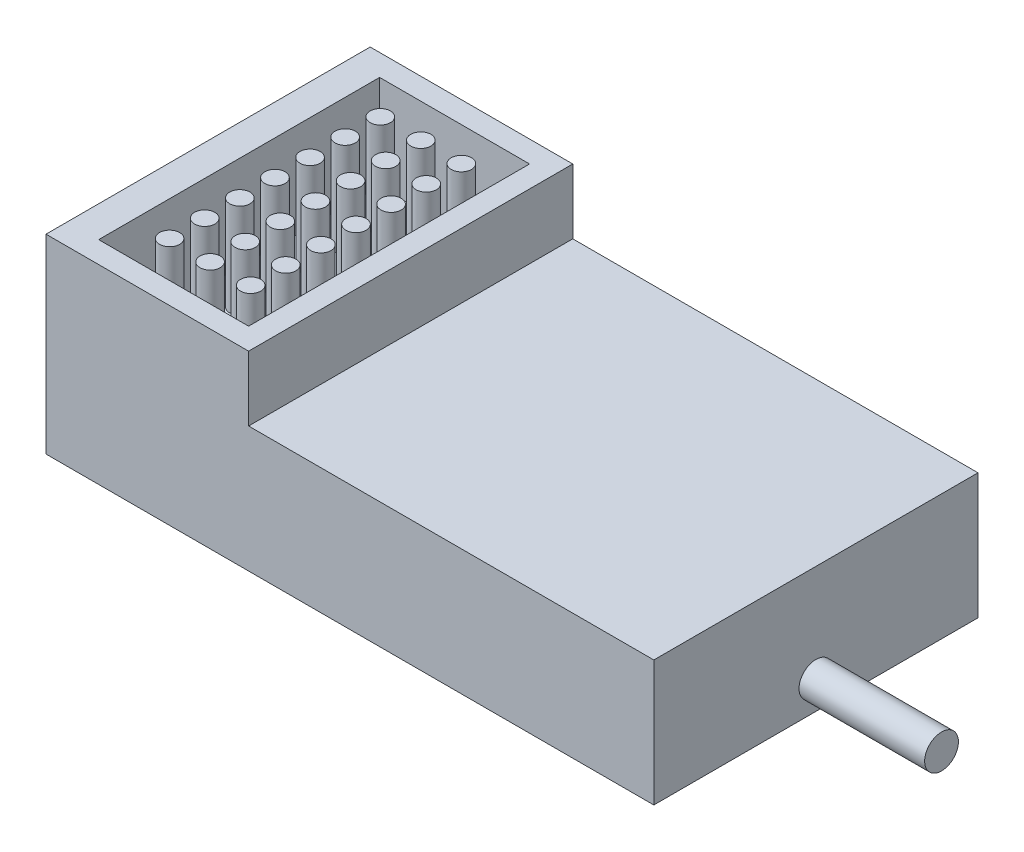
ISO-10303-21;
HEADER;
FILE_DESCRIPTION(('STEP AP214'),'2;1');
FILE_NAME('part.step','',(''),(''),'','','');
FILE_SCHEMA(('AUTOMOTIVE_DESIGN { 1 0 10303 214 1 1 1 1 }'));
ENDSEC;
DATA;
#1=APPLICATION_CONTEXT('core data for automotive mechanical design processes');
#2=APPLICATION_PROTOCOL_DEFINITION('international standard','automotive_design',2000,#1);
#3=PRODUCT_CONTEXT('',#1,'mechanical');
#4=PRODUCT('Part','Part','',(#3));
#5=PRODUCT_RELATED_PRODUCT_CATEGORY('part','',(#4));
#6=PRODUCT_DEFINITION_FORMATION('','',#4);
#7=PRODUCT_DEFINITION_CONTEXT('part definition',#1,'design');
#8=PRODUCT_DEFINITION('design','',#6,#7);
#9=PRODUCT_DEFINITION_SHAPE('','',#8);
#10=(LENGTH_UNIT() NAMED_UNIT(*) SI_UNIT(.MILLI.,.METRE.));
#11=(NAMED_UNIT(*) PLANE_ANGLE_UNIT() SI_UNIT($,.RADIAN.));
#12=(NAMED_UNIT(*) SI_UNIT($,.STERADIAN.) SOLID_ANGLE_UNIT());
#13=UNCERTAINTY_MEASURE_WITH_UNIT(LENGTH_MEASURE(1.E-05),#10,'distance_accuracy_value','');
#14=(GEOMETRIC_REPRESENTATION_CONTEXT(3) GLOBAL_UNCERTAINTY_ASSIGNED_CONTEXT((#13)) GLOBAL_UNIT_ASSIGNED_CONTEXT((#10,
#11,#12)) REPRESENTATION_CONTEXT('',''));
#15=CARTESIAN_POINT('',(0.,0.,0.));
#16=DIRECTION('',(0.,0.,1.));
#17=DIRECTION('',(1.,0.,0.));
#18=AXIS2_PLACEMENT_3D('',#15,#16,#17);
#19=CARTESIAN_POINT('',(0.,9.3,0.));
#20=DIRECTION('',(0.,-1.,0.));
#21=DIRECTION('',(0.,0.,-1.));
#22=AXIS2_PLACEMENT_3D('',#19,#20,#21);
#23=PLANE('',#22);
#24=DIRECTION('',(0.,0.,-1.));
#25=VECTOR('',#24,1.);
#26=CARTESIAN_POINT('',(15.,9.3,-24.));
#27=LINE('',#26,#25);
#28=CARTESIAN_POINT('',(15.,9.3,0.));
#29=VERTEX_POINT('',#28);
#30=CARTESIAN_POINT('',(15.,9.3,-24.));
#31=VERTEX_POINT('',#30);
#32=EDGE_CURVE('E56',#29,#31,#27,.T.);
#33=ORIENTED_EDGE('',*,*,#32,.F.);
#34=DIRECTION('',(1.,0.,0.));
#35=VECTOR('',#34,1.);
#36=CARTESIAN_POINT('',(0.,9.3,0.));
#37=LINE('',#36,#35);
#38=CARTESIAN_POINT('',(45.,9.3,0.));
#39=VERTEX_POINT('',#38);
#40=EDGE_CURVE('E173',#29,#39,#37,.T.);
#41=ORIENTED_EDGE('',*,*,#40,.T.);
#42=DIRECTION('',(0.,0.,-1.));
#43=VECTOR('',#42,1.);
#44=CARTESIAN_POINT('',(45.,9.3,0.));
#45=LINE('',#44,#43);
#46=CARTESIAN_POINT('',(45.,9.3,-24.));
#47=VERTEX_POINT('',#46);
#48=EDGE_CURVE('E175',#39,#47,#45,.T.);
#49=ORIENTED_EDGE('',*,*,#48,.T.);
#50=DIRECTION('',(-1.,0.,0.));
#51=VECTOR('',#50,1.);
#52=CARTESIAN_POINT('',(0.,9.3,-24.));
#53=LINE('',#52,#51);
#54=EDGE_CURVE('E178',#47,#31,#53,.T.);
#55=ORIENTED_EDGE('',*,*,#54,.T.);
#56=EDGE_LOOP('',(#33,#41,#49,#55));
#57=FACE_BOUND('',#56,.T.);
#58=ADVANCED_FACE('F33',(#57),#23,.F.);
#59=CARTESIAN_POINT('',(0.,9.3,0.));
#60=DIRECTION('',(1.,0.,0.));
#61=DIRECTION('',(0.,0.,-1.));
#62=AXIS2_PLACEMENT_3D('',#59,#60,#61);
#63=PLANE('',#62);
#64=DIRECTION('',(0.,0.,1.));
#65=VECTOR('',#64,1.);
#66=CARTESIAN_POINT('',(0.,0.,0.));
#67=LINE('',#66,#65);
#68=CARTESIAN_POINT('',(0.,0.,-24.));
#69=VERTEX_POINT('',#68);
#70=CARTESIAN_POINT('',(0.,0.,0.));
#71=VERTEX_POINT('',#70);
#72=EDGE_CURVE('E172',#69,#71,#67,.T.);
#73=ORIENTED_EDGE('',*,*,#72,.T.);
#74=DIRECTION('',(0.,-1.,0.));
#75=VECTOR('',#74,1.);
#76=CARTESIAN_POINT('',(0.,9.3,0.));
#77=LINE('',#76,#75);
#78=CARTESIAN_POINT('',(0.,14.1,0.));
#79=VERTEX_POINT('',#78);
#80=EDGE_CURVE('E41',#79,#71,#77,.T.);
#81=ORIENTED_EDGE('',*,*,#80,.F.);
#82=DIRECTION('',(0.,0.,1.));
#83=VECTOR('',#82,1.);
#84=CARTESIAN_POINT('',(0.,14.1,-24.));
#85=LINE('',#84,#83);
#86=CARTESIAN_POINT('',(0.,14.1,-24.));
#87=VERTEX_POINT('',#86);
#88=EDGE_CURVE('E152',#87,#79,#85,.T.);
#89=ORIENTED_EDGE('',*,*,#88,.F.);
#90=DIRECTION('',(0.,-1.,0.));
#91=VECTOR('',#90,1.);
#92=CARTESIAN_POINT('',(0.,9.3,-24.));
#93=LINE('',#92,#91);
#94=EDGE_CURVE('E180',#87,#69,#93,.T.);
#95=ORIENTED_EDGE('',*,*,#94,.T.);
#96=EDGE_LOOP('',(#73,#81,#89,#95));
#97=FACE_BOUND('',#96,.T.);
#98=ADVANCED_FACE('F35',(#97),#63,.F.);
#99=CARTESIAN_POINT('',(0.,9.3,0.));
#100=DIRECTION('',(0.,0.,-1.));
#101=DIRECTION('',(-1.,0.,0.));
#102=AXIS2_PLACEMENT_3D('',#99,#100,#101);
#103=PLANE('',#102);
#104=DIRECTION('',(1.,0.,0.));
#105=VECTOR('',#104,1.);
#106=CARTESIAN_POINT('',(0.,0.,0.));
#107=LINE('',#106,#105);
#108=CARTESIAN_POINT('',(45.,0.,0.));
#109=VERTEX_POINT('',#108);
#110=EDGE_CURVE('E183',#71,#109,#107,.T.);
#111=ORIENTED_EDGE('',*,*,#110,.T.);
#112=DIRECTION('',(0.,-1.,0.));
#113=VECTOR('',#112,1.);
#114=CARTESIAN_POINT('',(45.,9.3,0.));
#115=LINE('',#114,#113);
#116=EDGE_CURVE('E193',#39,#109,#115,.T.);
#117=ORIENTED_EDGE('',*,*,#116,.F.);
#118=ORIENTED_EDGE('',*,*,#40,.F.);
#119=DIRECTION('',(0.,-1.,0.));
#120=VECTOR('',#119,1.);
#121=CARTESIAN_POINT('',(15.,14.1,0.));
#122=LINE('',#121,#120);
#123=CARTESIAN_POINT('',(15.,14.1,0.));
#124=VERTEX_POINT('',#123);
#125=EDGE_CURVE('E166',#124,#29,#122,.T.);
#126=ORIENTED_EDGE('',*,*,#125,.F.);
#127=DIRECTION('',(1.,0.,0.));
#128=VECTOR('',#127,1.);
#129=CARTESIAN_POINT('',(0.,14.1,0.));
#130=LINE('',#129,#128);
#131=EDGE_CURVE('E155',#79,#124,#130,.T.);
#132=ORIENTED_EDGE('',*,*,#131,.F.);
#133=ORIENTED_EDGE('',*,*,#80,.T.);
#134=EDGE_LOOP('',(#111,#117,#118,#126,#132,#133));
#135=FACE_BOUND('',#134,.T.);
#136=ADVANCED_FACE('F198',(#135),#103,.F.);
#137=CARTESIAN_POINT('',(45.,9.3,0.));
#138=DIRECTION('',(-1.,0.,0.));
#139=DIRECTION('',(0.,0.,1.));
#140=AXIS2_PLACEMENT_3D('',#137,#138,#139);
#141=PLANE('',#140);
#142=CARTESIAN_POINT('',(45.,2.08344987117925,-12.));
#143=DIRECTION('',(-1.,0.,0.));
#144=DIRECTION('',(0.,0.,1.));
#145=AXIS2_PLACEMENT_3D('',#142,#143,#144);
#146=CIRCLE('',#145,1.25);
#147=CARTESIAN_POINT('',(45.,2.08344987117925,-10.75));
#148=VERTEX_POINT('',#147);
#149=EDGE_CURVE('E11',#148,#148,#146,.F.);
#150=ORIENTED_EDGE('',*,*,#149,.F.);
#151=EDGE_LOOP('',(#150));
#152=FACE_BOUND('',#151,.T.);
#153=DIRECTION('',(0.,0.,-1.));
#154=VECTOR('',#153,1.);
#155=CARTESIAN_POINT('',(45.,0.,0.));
#156=LINE('',#155,#154);
#157=CARTESIAN_POINT('',(45.,0.,-24.));
#158=VERTEX_POINT('',#157);
#159=EDGE_CURVE('E185',#109,#158,#156,.T.);
#160=ORIENTED_EDGE('',*,*,#159,.T.);
#161=DIRECTION('',(0.,-1.,0.));
#162=VECTOR('',#161,1.);
#163=CARTESIAN_POINT('',(45.,9.3,-24.));
#164=LINE('',#163,#162);
#165=EDGE_CURVE('E190',#47,#158,#164,.T.);
#166=ORIENTED_EDGE('',*,*,#165,.F.);
#167=ORIENTED_EDGE('',*,*,#48,.F.);
#168=ORIENTED_EDGE('',*,*,#116,.T.);
#169=EDGE_LOOP('',(#160,#166,#167,#168));
#170=FACE_BOUND('',#169,.T.);
#171=ADVANCED_FACE('F210',(#152,#170),#141,.F.);
#172=CARTESIAN_POINT('',(0.,9.3,-24.));
#173=DIRECTION('',(0.,0.,1.));
#174=DIRECTION('',(1.,0.,0.));
#175=AXIS2_PLACEMENT_3D('',#172,#173,#174);
#176=PLANE('',#175);
#177=DIRECTION('',(-1.,0.,0.));
#178=VECTOR('',#177,1.);
#179=CARTESIAN_POINT('',(0.,0.,-24.));
#180=LINE('',#179,#178);
#181=EDGE_CURVE('E176',#158,#69,#180,.T.);
#182=ORIENTED_EDGE('',*,*,#181,.T.);
#183=ORIENTED_EDGE('',*,*,#94,.F.);
#184=DIRECTION('',(-1.,0.,0.));
#185=VECTOR('',#184,1.);
#186=CARTESIAN_POINT('',(0.,14.1,-24.));
#187=LINE('',#186,#185);
#188=CARTESIAN_POINT('',(15.,14.1,-24.));
#189=VERTEX_POINT('',#188);
#190=EDGE_CURVE('E159',#189,#87,#187,.T.);
#191=ORIENTED_EDGE('',*,*,#190,.F.);
#192=DIRECTION('',(0.,-1.,0.));
#193=VECTOR('',#192,1.);
#194=CARTESIAN_POINT('',(15.,14.1,-24.));
#195=LINE('',#194,#193);
#196=EDGE_CURVE('E162',#189,#31,#195,.T.);
#197=ORIENTED_EDGE('',*,*,#196,.T.);
#198=ORIENTED_EDGE('',*,*,#54,.F.);
#199=ORIENTED_EDGE('',*,*,#165,.T.);
#200=EDGE_LOOP('',(#182,#183,#191,#197,#198,#199));
#201=FACE_BOUND('',#200,.T.);
#202=ADVANCED_FACE('F214',(#201),#176,.F.);
#203=CARTESIAN_POINT('',(0.,0.,0.));
#204=DIRECTION('',(0.,-1.,0.));
#205=DIRECTION('',(0.,0.,-1.));
#206=AXIS2_PLACEMENT_3D('',#203,#204,#205);
#207=PLANE('',#206);
#208=ORIENTED_EDGE('',*,*,#72,.F.);
#209=ORIENTED_EDGE('',*,*,#181,.F.);
#210=ORIENTED_EDGE('',*,*,#159,.F.);
#211=ORIENTED_EDGE('',*,*,#110,.F.);
#212=EDGE_LOOP('',(#208,#209,#210,#211));
#213=FACE_BOUND('',#212,.T.);
#214=ADVANCED_FACE('F206',(#213),#207,.T.);
#215=CARTESIAN_POINT('',(54.3,2.08344987117925,-12.));
#216=DIRECTION('',(-1.,0.,0.));
#217=DIRECTION('',(0.,0.,1.));
#218=AXIS2_PLACEMENT_3D('',#215,#216,#217);
#219=CYLINDRICAL_SURFACE('',#218,1.25);
#220=CARTESIAN_POINT('',(54.3,2.08344987117925,-12.));
#221=DIRECTION('',(1.,0.,0.));
#222=DIRECTION('',(0.,0.,-1.));
#223=AXIS2_PLACEMENT_3D('',#220,#221,#222);
#224=CIRCLE('',#223,1.25);
#225=CARTESIAN_POINT('',(54.3,2.08344987117925,-13.25));
#226=VERTEX_POINT('',#225);
#227=EDGE_CURVE('E169',#226,#226,#224,.T.);
#228=ORIENTED_EDGE('',*,*,#227,.F.);
#229=EDGE_LOOP('',(#228));
#230=FACE_BOUND('',#229,.T.);
#231=ORIENTED_EDGE('',*,*,#149,.T.);
#232=EDGE_LOOP('',(#231));
#233=FACE_BOUND('',#232,.T.);
#234=ADVANCED_FACE('F248',(#230,#233),#219,.T.);
#235=CARTESIAN_POINT('',(54.3,2.08344987117925,-12.));
#236=DIRECTION('',(1.,0.,0.));
#237=DIRECTION('',(0.,0.,-1.));
#238=AXIS2_PLACEMENT_3D('',#235,#236,#237);
#239=PLANE('',#238);
#240=ORIENTED_EDGE('',*,*,#227,.T.);
#241=EDGE_LOOP('',(#240));
#242=FACE_BOUND('',#241,.T.);
#243=ADVANCED_FACE('F233',(#242),#239,.T.);
#244=CARTESIAN_POINT('',(15.,14.1,-24.));
#245=DIRECTION('',(-1.,0.,0.));
#246=DIRECTION('',(0.,0.,1.));
#247=AXIS2_PLACEMENT_3D('',#244,#245,#246);
#248=PLANE('',#247);
#249=ORIENTED_EDGE('',*,*,#32,.T.);
#250=ORIENTED_EDGE('',*,*,#196,.F.);
#251=DIRECTION('',(0.,0.,-1.));
#252=VECTOR('',#251,1.);
#253=CARTESIAN_POINT('',(15.,14.1,-24.));
#254=LINE('',#253,#252);
#255=EDGE_CURVE('E157',#124,#189,#254,.T.);
#256=ORIENTED_EDGE('',*,*,#255,.F.);
#257=ORIENTED_EDGE('',*,*,#125,.T.);
#258=EDGE_LOOP('',(#249,#250,#256,#257));
#259=FACE_BOUND('',#258,.T.);
#260=ADVANCED_FACE('F218',(#259),#248,.F.);
#261=CARTESIAN_POINT('',(0.,14.1,0.));
#262=DIRECTION('',(0.,1.,0.));
#263=DIRECTION('',(0.,0.,1.));
#264=AXIS2_PLACEMENT_3D('',#261,#262,#263);
#265=PLANE('',#264);
#266=DIRECTION('',(0.,0.,1.));
#267=VECTOR('',#266,1.);
#268=CARTESIAN_POINT('',(2.3,14.1,-22.4));
#269=LINE('',#268,#267);
#270=CARTESIAN_POINT('',(2.3,14.1,-22.4));
#271=VERTEX_POINT('',#270);
#272=CARTESIAN_POINT('',(2.3,14.1,-1.6));
#273=VERTEX_POINT('',#272);
#274=EDGE_CURVE('E48',#271,#273,#269,.T.);
#275=ORIENTED_EDGE('',*,*,#274,.F.);
#276=DIRECTION('',(-1.,0.,0.));
#277=VECTOR('',#276,1.);
#278=CARTESIAN_POINT('',(2.3,14.1,-22.4));
#279=LINE('',#278,#277);
#280=CARTESIAN_POINT('',(13.4,14.1,-22.4));
#281=VERTEX_POINT('',#280);
#282=EDGE_CURVE('E130',#281,#271,#279,.T.);
#283=ORIENTED_EDGE('',*,*,#282,.F.);
#284=DIRECTION('',(0.,0.,-1.));
#285=VECTOR('',#284,1.);
#286=CARTESIAN_POINT('',(13.4,14.1,-22.4));
#287=LINE('',#286,#285);
#288=CARTESIAN_POINT('',(13.4,14.1,-1.6));
#289=VERTEX_POINT('',#288);
#290=EDGE_CURVE('E133',#289,#281,#287,.T.);
#291=ORIENTED_EDGE('',*,*,#290,.F.);
#292=DIRECTION('',(1.,0.,0.));
#293=VECTOR('',#292,1.);
#294=CARTESIAN_POINT('',(2.3,14.1,-1.6));
#295=LINE('',#294,#293);
#296=EDGE_CURVE('E142',#273,#289,#295,.T.);
#297=ORIENTED_EDGE('',*,*,#296,.F.);
#298=EDGE_LOOP('',(#275,#283,#291,#297));
#299=FACE_BOUND('',#298,.T.);
#300=ORIENTED_EDGE('',*,*,#88,.T.);
#301=ORIENTED_EDGE('',*,*,#131,.T.);
#302=ORIENTED_EDGE('',*,*,#255,.T.);
#303=ORIENTED_EDGE('',*,*,#190,.T.);
#304=EDGE_LOOP('',(#300,#301,#302,#303));
#305=FACE_BOUND('',#304,.T.);
#306=ADVANCED_FACE('F221',(#299,#305),#265,.T.);
#307=CARTESIAN_POINT('',(2.3,7.1,-22.4));
#308=DIRECTION('',(-1.,0.,0.));
#309=DIRECTION('',(0.,0.,1.));
#310=AXIS2_PLACEMENT_3D('',#307,#308,#309);
#311=PLANE('',#310);
#312=ORIENTED_EDGE('',*,*,#274,.T.);
#313=DIRECTION('',(0.,1.,0.));
#314=VECTOR('',#313,1.);
#315=CARTESIAN_POINT('',(2.3,7.1,-1.6));
#316=LINE('',#315,#314);
#317=CARTESIAN_POINT('',(2.3,7.1,-1.6));
#318=VERTEX_POINT('',#317);
#319=EDGE_CURVE('E108',#318,#273,#316,.T.);
#320=ORIENTED_EDGE('',*,*,#319,.F.);
#321=DIRECTION('',(0.,0.,1.));
#322=VECTOR('',#321,1.);
#323=CARTESIAN_POINT('',(2.3,7.1,-22.4));
#324=LINE('',#323,#322);
#325=CARTESIAN_POINT('',(2.3,7.1,-22.4));
#326=VERTEX_POINT('',#325);
#327=EDGE_CURVE('E112',#326,#318,#324,.T.);
#328=ORIENTED_EDGE('',*,*,#327,.F.);
#329=DIRECTION('',(0.,1.,0.));
#330=VECTOR('',#329,1.);
#331=CARTESIAN_POINT('',(2.3,7.1,-22.4));
#332=LINE('',#331,#330);
#333=EDGE_CURVE('E147',#326,#271,#332,.T.);
#334=ORIENTED_EDGE('',*,*,#333,.T.);
#335=EDGE_LOOP('',(#312,#320,#328,#334));
#336=FACE_BOUND('',#335,.T.);
#337=ADVANCED_FACE('F110',(#336),#311,.F.);
#338=CARTESIAN_POINT('',(2.3,7.1,-22.4));
#339=DIRECTION('',(0.,0.,-1.));
#340=DIRECTION('',(-1.,0.,0.));
#341=AXIS2_PLACEMENT_3D('',#338,#339,#340);
#342=PLANE('',#341);
#343=ORIENTED_EDGE('',*,*,#282,.T.);
#344=ORIENTED_EDGE('',*,*,#333,.F.);
#345=DIRECTION('',(-1.,0.,0.));
#346=VECTOR('',#345,1.);
#347=CARTESIAN_POINT('',(2.3,7.1,-22.4));
#348=LINE('',#347,#346);
#349=CARTESIAN_POINT('',(13.4,7.1,-22.4));
#350=VERTEX_POINT('',#349);
#351=EDGE_CURVE('E118',#350,#326,#348,.T.);
#352=ORIENTED_EDGE('',*,*,#351,.F.);
#353=DIRECTION('',(0.,1.,0.));
#354=VECTOR('',#353,1.);
#355=CARTESIAN_POINT('',(13.4,7.1,-22.4));
#356=LINE('',#355,#354);
#357=EDGE_CURVE('E149',#350,#281,#356,.T.);
#358=ORIENTED_EDGE('',*,*,#357,.T.);
#359=EDGE_LOOP('',(#343,#344,#352,#358));
#360=FACE_BOUND('',#359,.T.);
#361=ADVANCED_FACE('F231',(#360),#342,.F.);
#362=CARTESIAN_POINT('',(13.4,7.1,-22.4));
#363=DIRECTION('',(1.,0.,0.));
#364=DIRECTION('',(0.,0.,-1.));
#365=AXIS2_PLACEMENT_3D('',#362,#363,#364);
#366=PLANE('',#365);
#367=ORIENTED_EDGE('',*,*,#290,.T.);
#368=ORIENTED_EDGE('',*,*,#357,.F.);
#369=DIRECTION('',(0.,0.,-1.));
#370=VECTOR('',#369,1.);
#371=CARTESIAN_POINT('',(13.4,7.1,-22.4));
#372=LINE('',#371,#370);
#373=CARTESIAN_POINT('',(13.4,7.1,-1.6));
#374=VERTEX_POINT('',#373);
#375=EDGE_CURVE('E126',#374,#350,#372,.T.);
#376=ORIENTED_EDGE('',*,*,#375,.F.);
#377=DIRECTION('',(0.,1.,0.));
#378=VECTOR('',#377,1.);
#379=CARTESIAN_POINT('',(13.4,7.1,-1.6));
#380=LINE('',#379,#378);
#381=EDGE_CURVE('E117',#374,#289,#380,.T.);
#382=ORIENTED_EDGE('',*,*,#381,.T.);
#383=EDGE_LOOP('',(#367,#368,#376,#382));
#384=FACE_BOUND('',#383,.T.);
#385=ADVANCED_FACE('F310',(#384),#366,.F.);
#386=CARTESIAN_POINT('',(2.3,7.1,-1.6));
#387=DIRECTION('',(0.,0.,1.));
#388=DIRECTION('',(1.,0.,0.));
#389=AXIS2_PLACEMENT_3D('',#386,#387,#388);
#390=PLANE('',#389);
#391=ORIENTED_EDGE('',*,*,#296,.T.);
#392=ORIENTED_EDGE('',*,*,#381,.F.);
#393=DIRECTION('',(1.,0.,0.));
#394=VECTOR('',#393,1.);
#395=CARTESIAN_POINT('',(2.3,7.1,-1.6));
#396=LINE('',#395,#394);
#397=EDGE_CURVE('E121',#318,#374,#396,.T.);
#398=ORIENTED_EDGE('',*,*,#397,.F.);
#399=ORIENTED_EDGE('',*,*,#319,.T.);
#400=EDGE_LOOP('',(#391,#392,#398,#399));
#401=FACE_BOUND('',#400,.T.);
#402=ADVANCED_FACE('F122',(#401),#390,.F.);
#403=CARTESIAN_POINT('',(0.,7.1,0.));
#404=DIRECTION('',(0.,1.,0.));
#405=DIRECTION('',(0.,0.,1.));
#406=AXIS2_PLACEMENT_3D('',#403,#404,#405);
#407=PLANE('',#406);
#408=CARTESIAN_POINT('',(10.8500000000002,7.1,-4.3));
#409=DIRECTION('',(0.,1.,0.));
#410=DIRECTION('',(0.,0.,1.));
#411=AXIS2_PLACEMENT_3D('',#408,#409,#410);
#412=CIRCLE('',#411,0.75);
#413=CARTESIAN_POINT('',(10.8500000000002,7.1,-3.55));
#414=VERTEX_POINT('',#413);
#415=EDGE_CURVE('E851',#414,#414,#412,.T.);
#416=ORIENTED_EDGE('',*,*,#415,.F.);
#417=EDGE_LOOP('',(#416));
#418=FACE_BOUND('',#417,.T.);
#419=CARTESIAN_POINT('',(7.85000000000016,7.1,-4.3));
#420=DIRECTION('',(0.,1.,0.));
#421=DIRECTION('',(0.,0.,1.));
#422=AXIS2_PLACEMENT_3D('',#419,#420,#421);
#423=CIRCLE('',#422,0.75);
#424=CARTESIAN_POINT('',(7.85000000000016,7.1,-3.55));
#425=VERTEX_POINT('',#424);
#426=EDGE_CURVE('E845',#425,#425,#423,.T.);
#427=ORIENTED_EDGE('',*,*,#426,.F.);
#428=EDGE_LOOP('',(#427));
#429=FACE_BOUND('',#428,.T.);
#430=CARTESIAN_POINT('',(4.85000000000016,7.1,-4.3));
#431=DIRECTION('',(0.,1.,0.));
#432=DIRECTION('',(0.,0.,1.));
#433=AXIS2_PLACEMENT_3D('',#430,#431,#432);
#434=CIRCLE('',#433,0.750000000000001);
#435=CARTESIAN_POINT('',(4.85000000000016,7.1,-3.55));
#436=VERTEX_POINT('',#435);
#437=EDGE_CURVE('E839',#436,#436,#434,.T.);
#438=ORIENTED_EDGE('',*,*,#437,.F.);
#439=EDGE_LOOP('',(#438));
#440=FACE_BOUND('',#439,.T.);
#441=CARTESIAN_POINT('',(10.8500000000001,7.1,-6.9));
#442=DIRECTION('',(0.,1.,0.));
#443=DIRECTION('',(0.,0.,1.));
#444=AXIS2_PLACEMENT_3D('',#441,#442,#443);
#445=CIRCLE('',#444,0.75);
#446=CARTESIAN_POINT('',(10.8500000000001,7.1,-6.15));
#447=VERTEX_POINT('',#446);
#448=EDGE_CURVE('E833',#447,#447,#445,.T.);
#449=ORIENTED_EDGE('',*,*,#448,.F.);
#450=EDGE_LOOP('',(#449));
#451=FACE_BOUND('',#450,.T.);
#452=CARTESIAN_POINT('',(7.85000000000014,7.1,-6.9));
#453=DIRECTION('',(0.,1.,0.));
#454=DIRECTION('',(0.,0.,1.));
#455=AXIS2_PLACEMENT_3D('',#452,#453,#454);
#456=CIRCLE('',#455,0.75);
#457=CARTESIAN_POINT('',(7.85000000000014,7.1,-6.15));
#458=VERTEX_POINT('',#457);
#459=EDGE_CURVE('E827',#458,#458,#456,.T.);
#460=ORIENTED_EDGE('',*,*,#459,.F.);
#461=EDGE_LOOP('',(#460));
#462=FACE_BOUND('',#461,.T.);
#463=CARTESIAN_POINT('',(4.85000000000014,7.1,-6.9));
#464=DIRECTION('',(0.,1.,0.));
#465=DIRECTION('',(0.,0.,1.));
#466=AXIS2_PLACEMENT_3D('',#463,#464,#465);
#467=CIRCLE('',#466,0.750000000000001);
#468=CARTESIAN_POINT('',(4.85000000000014,7.1,-6.15));
#469=VERTEX_POINT('',#468);
#470=EDGE_CURVE('E821',#469,#469,#467,.T.);
#471=ORIENTED_EDGE('',*,*,#470,.F.);
#472=EDGE_LOOP('',(#471));
#473=FACE_BOUND('',#472,.T.);
#474=CARTESIAN_POINT('',(10.8500000000001,7.1,-9.5));
#475=DIRECTION('',(0.,1.,0.));
#476=DIRECTION('',(0.,0.,1.));
#477=AXIS2_PLACEMENT_3D('',#474,#475,#476);
#478=CIRCLE('',#477,0.75);
#479=CARTESIAN_POINT('',(10.8500000000001,7.1,-8.75));
#480=VERTEX_POINT('',#479);
#481=EDGE_CURVE('E815',#480,#480,#478,.T.);
#482=ORIENTED_EDGE('',*,*,#481,.F.);
#483=EDGE_LOOP('',(#482));
#484=FACE_BOUND('',#483,.T.);
#485=CARTESIAN_POINT('',(7.85000000000011,7.1,-9.5));
#486=DIRECTION('',(0.,1.,0.));
#487=DIRECTION('',(0.,0.,1.));
#488=AXIS2_PLACEMENT_3D('',#485,#486,#487);
#489=CIRCLE('',#488,0.75);
#490=CARTESIAN_POINT('',(7.85000000000011,7.1,-8.75));
#491=VERTEX_POINT('',#490);
#492=EDGE_CURVE('E809',#491,#491,#489,.T.);
#493=ORIENTED_EDGE('',*,*,#492,.F.);
#494=EDGE_LOOP('',(#493));
#495=FACE_BOUND('',#494,.T.);
#496=CARTESIAN_POINT('',(4.85000000000011,7.1,-9.5));
#497=DIRECTION('',(0.,1.,0.));
#498=DIRECTION('',(0.,0.,1.));
#499=AXIS2_PLACEMENT_3D('',#496,#497,#498);
#500=CIRCLE('',#499,0.750000000000001);
#501=CARTESIAN_POINT('',(4.85000000000011,7.1,-8.75));
#502=VERTEX_POINT('',#501);
#503=EDGE_CURVE('E803',#502,#502,#500,.T.);
#504=ORIENTED_EDGE('',*,*,#503,.F.);
#505=EDGE_LOOP('',(#504));
#506=FACE_BOUND('',#505,.T.);
#507=CARTESIAN_POINT('',(10.8500000000001,7.1,-12.1));
#508=DIRECTION('',(0.,1.,0.));
#509=DIRECTION('',(0.,0.,1.));
#510=AXIS2_PLACEMENT_3D('',#507,#508,#509);
#511=CIRCLE('',#510,0.75);
#512=CARTESIAN_POINT('',(10.8500000000001,7.1,-11.35));
#513=VERTEX_POINT('',#512);
#514=EDGE_CURVE('E797',#513,#513,#511,.T.);
#515=ORIENTED_EDGE('',*,*,#514,.F.);
#516=EDGE_LOOP('',(#515));
#517=FACE_BOUND('',#516,.T.);
#518=CARTESIAN_POINT('',(7.85000000000008,7.1,-12.1));
#519=DIRECTION('',(0.,1.,0.));
#520=DIRECTION('',(0.,0.,1.));
#521=AXIS2_PLACEMENT_3D('',#518,#519,#520);
#522=CIRCLE('',#521,0.75);
#523=CARTESIAN_POINT('',(7.85000000000008,7.1,-11.35));
#524=VERTEX_POINT('',#523);
#525=EDGE_CURVE('E791',#524,#524,#522,.T.);
#526=ORIENTED_EDGE('',*,*,#525,.F.);
#527=EDGE_LOOP('',(#526));
#528=FACE_BOUND('',#527,.T.);
#529=CARTESIAN_POINT('',(4.85000000000008,7.1,-12.1));
#530=DIRECTION('',(0.,1.,0.));
#531=DIRECTION('',(0.,0.,1.));
#532=AXIS2_PLACEMENT_3D('',#529,#530,#531);
#533=CIRCLE('',#532,0.750000000000001);
#534=CARTESIAN_POINT('',(4.85000000000008,7.1,-11.35));
#535=VERTEX_POINT('',#534);
#536=EDGE_CURVE('E785',#535,#535,#533,.T.);
#537=ORIENTED_EDGE('',*,*,#536,.F.);
#538=EDGE_LOOP('',(#537));
#539=FACE_BOUND('',#538,.T.);
#540=CARTESIAN_POINT('',(10.8500000000001,7.1,-14.7));
#541=DIRECTION('',(0.,1.,0.));
#542=DIRECTION('',(0.,0.,1.));
#543=AXIS2_PLACEMENT_3D('',#540,#541,#542);
#544=CIRCLE('',#543,0.75);
#545=CARTESIAN_POINT('',(10.8500000000001,7.1,-13.95));
#546=VERTEX_POINT('',#545);
#547=EDGE_CURVE('E779',#546,#546,#544,.T.);
#548=ORIENTED_EDGE('',*,*,#547,.F.);
#549=EDGE_LOOP('',(#548));
#550=FACE_BOUND('',#549,.T.);
#551=CARTESIAN_POINT('',(7.85000000000005,7.1,-14.7));
#552=DIRECTION('',(0.,1.,0.));
#553=DIRECTION('',(0.,0.,1.));
#554=AXIS2_PLACEMENT_3D('',#551,#552,#553);
#555=CIRCLE('',#554,0.75);
#556=CARTESIAN_POINT('',(7.85000000000005,7.1,-13.95));
#557=VERTEX_POINT('',#556);
#558=EDGE_CURVE('E773',#557,#557,#555,.T.);
#559=ORIENTED_EDGE('',*,*,#558,.F.);
#560=EDGE_LOOP('',(#559));
#561=FACE_BOUND('',#560,.T.);
#562=CARTESIAN_POINT('',(4.85000000000006,7.1,-14.7));
#563=DIRECTION('',(0.,1.,0.));
#564=DIRECTION('',(0.,0.,1.));
#565=AXIS2_PLACEMENT_3D('',#562,#563,#564);
#566=CIRCLE('',#565,0.750000000000001);
#567=CARTESIAN_POINT('',(4.85000000000006,7.1,-13.95));
#568=VERTEX_POINT('',#567);
#569=EDGE_CURVE('E767',#568,#568,#566,.T.);
#570=ORIENTED_EDGE('',*,*,#569,.F.);
#571=EDGE_LOOP('',(#570));
#572=FACE_BOUND('',#571,.T.);
#573=CARTESIAN_POINT('',(10.85,7.1,-17.3));
#574=DIRECTION('',(0.,1.,0.));
#575=DIRECTION('',(0.,0.,1.));
#576=AXIS2_PLACEMENT_3D('',#573,#574,#575);
#577=CIRCLE('',#576,0.75);
#578=CARTESIAN_POINT('',(10.85,7.1,-16.55));
#579=VERTEX_POINT('',#578);
#580=EDGE_CURVE('E761',#579,#579,#577,.T.);
#581=ORIENTED_EDGE('',*,*,#580,.F.);
#582=EDGE_LOOP('',(#581));
#583=FACE_BOUND('',#582,.T.);
#584=CARTESIAN_POINT('',(7.85000000000003,7.1,-17.3));
#585=DIRECTION('',(0.,1.,0.));
#586=DIRECTION('',(0.,0.,1.));
#587=AXIS2_PLACEMENT_3D('',#584,#585,#586);
#588=CIRCLE('',#587,0.75);
#589=CARTESIAN_POINT('',(7.85000000000003,7.1,-16.55));
#590=VERTEX_POINT('',#589);
#591=EDGE_CURVE('E755',#590,#590,#588,.T.);
#592=ORIENTED_EDGE('',*,*,#591,.F.);
#593=EDGE_LOOP('',(#592));
#594=FACE_BOUND('',#593,.T.);
#595=CARTESIAN_POINT('',(4.85000000000003,7.1,-17.3));
#596=DIRECTION('',(0.,1.,0.));
#597=DIRECTION('',(0.,0.,1.));
#598=AXIS2_PLACEMENT_3D('',#595,#596,#597);
#599=CIRCLE('',#598,0.750000000000001);
#600=CARTESIAN_POINT('',(4.85000000000003,7.1,-16.55));
#601=VERTEX_POINT('',#600);
#602=EDGE_CURVE('E750',#601,#601,#599,.T.);
#603=ORIENTED_EDGE('',*,*,#602,.F.);
#604=EDGE_LOOP('',(#603));
#605=FACE_BOUND('',#604,.T.);
#606=CARTESIAN_POINT('',(10.85,7.1,-19.9));
#607=DIRECTION('',(0.,1.,0.));
#608=DIRECTION('',(0.,0.,1.));
#609=AXIS2_PLACEMENT_3D('',#606,#607,#608);
#610=CIRCLE('',#609,0.75);
#611=CARTESIAN_POINT('',(10.85,7.1,-19.15));
#612=VERTEX_POINT('',#611);
#613=EDGE_CURVE('E735',#612,#612,#610,.T.);
#614=ORIENTED_EDGE('',*,*,#613,.F.);
#615=EDGE_LOOP('',(#614));
#616=FACE_BOUND('',#615,.T.);
#617=CARTESIAN_POINT('',(7.85,7.1,-19.9));
#618=DIRECTION('',(0.,1.,0.));
#619=DIRECTION('',(0.,0.,1.));
#620=AXIS2_PLACEMENT_3D('',#617,#618,#619);
#621=CIRCLE('',#620,0.75);
#622=CARTESIAN_POINT('',(7.85,7.1,-19.15));
#623=VERTEX_POINT('',#622);
#624=EDGE_CURVE('E734',#623,#623,#621,.T.);
#625=ORIENTED_EDGE('',*,*,#624,.F.);
#626=EDGE_LOOP('',(#625));
#627=FACE_BOUND('',#626,.T.);
#628=CARTESIAN_POINT('',(4.85,7.1,-19.9));
#629=DIRECTION('',(0.,1.,0.));
#630=DIRECTION('',(0.,0.,1.));
#631=AXIS2_PLACEMENT_3D('',#628,#629,#630);
#632=CIRCLE('',#631,0.750000000000001);
#633=CARTESIAN_POINT('',(4.85,7.1,-19.15));
#634=VERTEX_POINT('',#633);
#635=EDGE_CURVE('E143',#634,#634,#632,.T.);
#636=ORIENTED_EDGE('',*,*,#635,.F.);
#637=EDGE_LOOP('',(#636));
#638=FACE_BOUND('',#637,.T.);
#639=ORIENTED_EDGE('',*,*,#327,.T.);
#640=ORIENTED_EDGE('',*,*,#397,.T.);
#641=ORIENTED_EDGE('',*,*,#375,.T.);
#642=ORIENTED_EDGE('',*,*,#351,.T.);
#643=EDGE_LOOP('',(#639,#640,#641,#642));
#644=FACE_BOUND('',#643,.T.);
#645=ADVANCED_FACE('F128',(#418,#429,#440,#451,#462,#473,#484,#495,#506,#517,#528,#539,#550,
#561,#572,#583,#594,#605,#616,#627,#638,#644),#407,.T.);
#646=CARTESIAN_POINT('',(4.85,7.1,-19.9));
#647=DIRECTION('',(0.,1.,0.));
#648=DIRECTION('',(0.,0.,1.));
#649=AXIS2_PLACEMENT_3D('',#646,#647,#648);
#650=CYLINDRICAL_SURFACE('',#649,0.750000000000001);
#651=ORIENTED_EDGE('',*,*,#635,.T.);
#652=EDGE_LOOP('',(#651));
#653=FACE_BOUND('',#652,.T.);
#654=CARTESIAN_POINT('',(4.85,14.1,-19.9));
#655=DIRECTION('',(0.,1.,0.));
#656=DIRECTION('',(0.,0.,1.));
#657=AXIS2_PLACEMENT_3D('',#654,#655,#656);
#658=CIRCLE('',#657,0.750000000000001);
#659=CARTESIAN_POINT('',(4.85,14.1,-19.15));
#660=VERTEX_POINT('',#659);
#661=EDGE_CURVE('E136',#660,#660,#658,.T.);
#662=ORIENTED_EDGE('',*,*,#661,.F.);
#663=EDGE_LOOP('',(#662));
#664=FACE_BOUND('',#663,.T.);
#665=ADVANCED_FACE('F337',(#653,#664),#650,.T.);
#666=CARTESIAN_POINT('',(7.85,7.1,-19.9));
#667=DIRECTION('',(0.,1.,0.));
#668=DIRECTION('',(0.,0.,1.));
#669=AXIS2_PLACEMENT_3D('',#666,#667,#668);
#670=CYLINDRICAL_SURFACE('',#669,0.75);
#671=ORIENTED_EDGE('',*,*,#624,.T.);
#672=EDGE_LOOP('',(#671));
#673=FACE_BOUND('',#672,.T.);
#674=CARTESIAN_POINT('',(7.85,14.1,-19.9));
#675=DIRECTION('',(0.,1.,0.));
#676=DIRECTION('',(0.,0.,1.));
#677=AXIS2_PLACEMENT_3D('',#674,#675,#676);
#678=CIRCLE('',#677,0.75);
#679=CARTESIAN_POINT('',(7.85,14.1,-19.15));
#680=VERTEX_POINT('',#679);
#681=EDGE_CURVE('E732',#680,#680,#678,.T.);
#682=ORIENTED_EDGE('',*,*,#681,.F.);
#683=EDGE_LOOP('',(#682));
#684=FACE_BOUND('',#683,.T.);
#685=ADVANCED_FACE('F347',(#673,#684),#670,.T.);
#686=CARTESIAN_POINT('',(10.85,7.1,-19.9));
#687=DIRECTION('',(0.,1.,0.));
#688=DIRECTION('',(0.,0.,1.));
#689=AXIS2_PLACEMENT_3D('',#686,#687,#688);
#690=CYLINDRICAL_SURFACE('',#689,0.75);
#691=ORIENTED_EDGE('',*,*,#613,.T.);
#692=EDGE_LOOP('',(#691));
#693=FACE_BOUND('',#692,.T.);
#694=CARTESIAN_POINT('',(10.85,14.1,-19.9));
#695=DIRECTION('',(0.,1.,0.));
#696=DIRECTION('',(0.,0.,1.));
#697=AXIS2_PLACEMENT_3D('',#694,#695,#696);
#698=CIRCLE('',#697,0.75);
#699=CARTESIAN_POINT('',(10.85,14.1,-19.15));
#700=VERTEX_POINT('',#699);
#701=EDGE_CURVE('E740',#700,#700,#698,.T.);
#702=ORIENTED_EDGE('',*,*,#701,.F.);
#703=EDGE_LOOP('',(#702));
#704=FACE_BOUND('',#703,.T.);
#705=ADVANCED_FACE('F357',(#693,#704),#690,.T.);
#706=CARTESIAN_POINT('',(4.85000000000003,7.1,-17.3));
#707=DIRECTION('',(0.,1.,0.));
#708=DIRECTION('',(0.,0.,1.));
#709=AXIS2_PLACEMENT_3D('',#706,#707,#708);
#710=CYLINDRICAL_SURFACE('',#709,0.750000000000001);
#711=ORIENTED_EDGE('',*,*,#602,.T.);
#712=EDGE_LOOP('',(#711));
#713=FACE_BOUND('',#712,.T.);
#714=CARTESIAN_POINT('',(4.85000000000003,14.1,-17.3));
#715=DIRECTION('',(0.,1.,0.));
#716=DIRECTION('',(0.,0.,1.));
#717=AXIS2_PLACEMENT_3D('',#714,#715,#716);
#718=CIRCLE('',#717,0.750000000000001);
#719=CARTESIAN_POINT('',(4.85000000000003,14.1,-16.55));
#720=VERTEX_POINT('',#719);
#721=EDGE_CURVE('E752',#720,#720,#718,.T.);
#722=ORIENTED_EDGE('',*,*,#721,.F.);
#723=EDGE_LOOP('',(#722));
#724=FACE_BOUND('',#723,.T.);
#725=ADVANCED_FACE('F367',(#713,#724),#710,.T.);
#726=CARTESIAN_POINT('',(7.85000000000003,7.1,-17.3));
#727=DIRECTION('',(0.,1.,0.));
#728=DIRECTION('',(0.,0.,1.));
#729=AXIS2_PLACEMENT_3D('',#726,#727,#728);
#730=CYLINDRICAL_SURFACE('',#729,0.75);
#731=ORIENTED_EDGE('',*,*,#591,.T.);
#732=EDGE_LOOP('',(#731));
#733=FACE_BOUND('',#732,.T.);
#734=CARTESIAN_POINT('',(7.85000000000003,14.1,-17.3));
#735=DIRECTION('',(0.,1.,0.));
#736=DIRECTION('',(0.,0.,1.));
#737=AXIS2_PLACEMENT_3D('',#734,#735,#736);
#738=CIRCLE('',#737,0.75);
#739=CARTESIAN_POINT('',(7.85000000000003,14.1,-16.55));
#740=VERTEX_POINT('',#739);
#741=EDGE_CURVE('E758',#740,#740,#738,.T.);
#742=ORIENTED_EDGE('',*,*,#741,.F.);
#743=EDGE_LOOP('',(#742));
#744=FACE_BOUND('',#743,.T.);
#745=ADVANCED_FACE('F377',(#733,#744),#730,.T.);
#746=CARTESIAN_POINT('',(10.85,7.1,-17.3));
#747=DIRECTION('',(0.,1.,0.));
#748=DIRECTION('',(0.,0.,1.));
#749=AXIS2_PLACEMENT_3D('',#746,#747,#748);
#750=CYLINDRICAL_SURFACE('',#749,0.75);
#751=ORIENTED_EDGE('',*,*,#580,.T.);
#752=EDGE_LOOP('',(#751));
#753=FACE_BOUND('',#752,.T.);
#754=CARTESIAN_POINT('',(10.85,14.1,-17.3));
#755=DIRECTION('',(0.,1.,0.));
#756=DIRECTION('',(0.,0.,1.));
#757=AXIS2_PLACEMENT_3D('',#754,#755,#756);
#758=CIRCLE('',#757,0.75);
#759=CARTESIAN_POINT('',(10.85,14.1,-16.55));
#760=VERTEX_POINT('',#759);
#761=EDGE_CURVE('E764',#760,#760,#758,.T.);
#762=ORIENTED_EDGE('',*,*,#761,.F.);
#763=EDGE_LOOP('',(#762));
#764=FACE_BOUND('',#763,.T.);
#765=ADVANCED_FACE('F387',(#753,#764),#750,.T.);
#766=CARTESIAN_POINT('',(4.85000000000006,7.1,-14.7));
#767=DIRECTION('',(0.,1.,0.));
#768=DIRECTION('',(0.,0.,1.));
#769=AXIS2_PLACEMENT_3D('',#766,#767,#768);
#770=CYLINDRICAL_SURFACE('',#769,0.750000000000001);
#771=ORIENTED_EDGE('',*,*,#569,.T.);
#772=EDGE_LOOP('',(#771));
#773=FACE_BOUND('',#772,.T.);
#774=CARTESIAN_POINT('',(4.85000000000006,14.1,-14.7));
#775=DIRECTION('',(0.,1.,0.));
#776=DIRECTION('',(0.,0.,1.));
#777=AXIS2_PLACEMENT_3D('',#774,#775,#776);
#778=CIRCLE('',#777,0.750000000000001);
#779=CARTESIAN_POINT('',(4.85000000000006,14.1,-13.95));
#780=VERTEX_POINT('',#779);
#781=EDGE_CURVE('E770',#780,#780,#778,.T.);
#782=ORIENTED_EDGE('',*,*,#781,.F.);
#783=EDGE_LOOP('',(#782));
#784=FACE_BOUND('',#783,.T.);
#785=ADVANCED_FACE('F397',(#773,#784),#770,.T.);
#786=CARTESIAN_POINT('',(7.85000000000005,7.1,-14.7));
#787=DIRECTION('',(0.,1.,0.));
#788=DIRECTION('',(0.,0.,1.));
#789=AXIS2_PLACEMENT_3D('',#786,#787,#788);
#790=CYLINDRICAL_SURFACE('',#789,0.75);
#791=ORIENTED_EDGE('',*,*,#558,.T.);
#792=EDGE_LOOP('',(#791));
#793=FACE_BOUND('',#792,.T.);
#794=CARTESIAN_POINT('',(7.85000000000005,14.1,-14.7));
#795=DIRECTION('',(0.,1.,0.));
#796=DIRECTION('',(0.,0.,1.));
#797=AXIS2_PLACEMENT_3D('',#794,#795,#796);
#798=CIRCLE('',#797,0.75);
#799=CARTESIAN_POINT('',(7.85000000000005,14.1,-13.95));
#800=VERTEX_POINT('',#799);
#801=EDGE_CURVE('E776',#800,#800,#798,.T.);
#802=ORIENTED_EDGE('',*,*,#801,.F.);
#803=EDGE_LOOP('',(#802));
#804=FACE_BOUND('',#803,.T.);
#805=ADVANCED_FACE('F407',(#793,#804),#790,.T.);
#806=CARTESIAN_POINT('',(10.8500000000001,7.1,-14.7));
#807=DIRECTION('',(0.,1.,0.));
#808=DIRECTION('',(0.,0.,1.));
#809=AXIS2_PLACEMENT_3D('',#806,#807,#808);
#810=CYLINDRICAL_SURFACE('',#809,0.75);
#811=ORIENTED_EDGE('',*,*,#547,.T.);
#812=EDGE_LOOP('',(#811));
#813=FACE_BOUND('',#812,.T.);
#814=CARTESIAN_POINT('',(10.8500000000001,14.1,-14.7));
#815=DIRECTION('',(0.,1.,0.));
#816=DIRECTION('',(0.,0.,1.));
#817=AXIS2_PLACEMENT_3D('',#814,#815,#816);
#818=CIRCLE('',#817,0.75);
#819=CARTESIAN_POINT('',(10.8500000000001,14.1,-13.95));
#820=VERTEX_POINT('',#819);
#821=EDGE_CURVE('E782',#820,#820,#818,.T.);
#822=ORIENTED_EDGE('',*,*,#821,.F.);
#823=EDGE_LOOP('',(#822));
#824=FACE_BOUND('',#823,.T.);
#825=ADVANCED_FACE('F417',(#813,#824),#810,.T.);
#826=CARTESIAN_POINT('',(4.85000000000008,7.1,-12.1));
#827=DIRECTION('',(0.,1.,0.));
#828=DIRECTION('',(0.,0.,1.));
#829=AXIS2_PLACEMENT_3D('',#826,#827,#828);
#830=CYLINDRICAL_SURFACE('',#829,0.750000000000001);
#831=ORIENTED_EDGE('',*,*,#536,.T.);
#832=EDGE_LOOP('',(#831));
#833=FACE_BOUND('',#832,.T.);
#834=CARTESIAN_POINT('',(4.85000000000008,14.1,-12.1));
#835=DIRECTION('',(0.,1.,0.));
#836=DIRECTION('',(0.,0.,1.));
#837=AXIS2_PLACEMENT_3D('',#834,#835,#836);
#838=CIRCLE('',#837,0.750000000000001);
#839=CARTESIAN_POINT('',(4.85000000000008,14.1,-11.35));
#840=VERTEX_POINT('',#839);
#841=EDGE_CURVE('E788',#840,#840,#838,.T.);
#842=ORIENTED_EDGE('',*,*,#841,.F.);
#843=EDGE_LOOP('',(#842));
#844=FACE_BOUND('',#843,.T.);
#845=ADVANCED_FACE('F427',(#833,#844),#830,.T.);
#846=CARTESIAN_POINT('',(7.85000000000008,7.1,-12.1));
#847=DIRECTION('',(0.,1.,0.));
#848=DIRECTION('',(0.,0.,1.));
#849=AXIS2_PLACEMENT_3D('',#846,#847,#848);
#850=CYLINDRICAL_SURFACE('',#849,0.75);
#851=ORIENTED_EDGE('',*,*,#525,.T.);
#852=EDGE_LOOP('',(#851));
#853=FACE_BOUND('',#852,.T.);
#854=CARTESIAN_POINT('',(7.85000000000008,14.1,-12.1));
#855=DIRECTION('',(0.,1.,0.));
#856=DIRECTION('',(0.,0.,1.));
#857=AXIS2_PLACEMENT_3D('',#854,#855,#856);
#858=CIRCLE('',#857,0.75);
#859=CARTESIAN_POINT('',(7.85000000000008,14.1,-11.35));
#860=VERTEX_POINT('',#859);
#861=EDGE_CURVE('E794',#860,#860,#858,.T.);
#862=ORIENTED_EDGE('',*,*,#861,.F.);
#863=EDGE_LOOP('',(#862));
#864=FACE_BOUND('',#863,.T.);
#865=ADVANCED_FACE('F437',(#853,#864),#850,.T.);
#866=CARTESIAN_POINT('',(10.8500000000001,7.1,-12.1));
#867=DIRECTION('',(0.,1.,0.));
#868=DIRECTION('',(0.,0.,1.));
#869=AXIS2_PLACEMENT_3D('',#866,#867,#868);
#870=CYLINDRICAL_SURFACE('',#869,0.75);
#871=ORIENTED_EDGE('',*,*,#514,.T.);
#872=EDGE_LOOP('',(#871));
#873=FACE_BOUND('',#872,.T.);
#874=CARTESIAN_POINT('',(10.8500000000001,14.1,-12.1));
#875=DIRECTION('',(0.,1.,0.));
#876=DIRECTION('',(0.,0.,1.));
#877=AXIS2_PLACEMENT_3D('',#874,#875,#876);
#878=CIRCLE('',#877,0.75);
#879=CARTESIAN_POINT('',(10.8500000000001,14.1,-11.35));
#880=VERTEX_POINT('',#879);
#881=EDGE_CURVE('E800',#880,#880,#878,.T.);
#882=ORIENTED_EDGE('',*,*,#881,.F.);
#883=EDGE_LOOP('',(#882));
#884=FACE_BOUND('',#883,.T.);
#885=ADVANCED_FACE('F447',(#873,#884),#870,.T.);
#886=CARTESIAN_POINT('',(4.85000000000011,7.1,-9.5));
#887=DIRECTION('',(0.,1.,0.));
#888=DIRECTION('',(0.,0.,1.));
#889=AXIS2_PLACEMENT_3D('',#886,#887,#888);
#890=CYLINDRICAL_SURFACE('',#889,0.750000000000001);
#891=ORIENTED_EDGE('',*,*,#503,.T.);
#892=EDGE_LOOP('',(#891));
#893=FACE_BOUND('',#892,.T.);
#894=CARTESIAN_POINT('',(4.85000000000011,14.1,-9.5));
#895=DIRECTION('',(0.,1.,0.));
#896=DIRECTION('',(0.,0.,1.));
#897=AXIS2_PLACEMENT_3D('',#894,#895,#896);
#898=CIRCLE('',#897,0.750000000000001);
#899=CARTESIAN_POINT('',(4.85000000000011,14.1,-8.75));
#900=VERTEX_POINT('',#899);
#901=EDGE_CURVE('E806',#900,#900,#898,.T.);
#902=ORIENTED_EDGE('',*,*,#901,.F.);
#903=EDGE_LOOP('',(#902));
#904=FACE_BOUND('',#903,.T.);
#905=ADVANCED_FACE('F457',(#893,#904),#890,.T.);
#906=CARTESIAN_POINT('',(7.85000000000011,7.1,-9.5));
#907=DIRECTION('',(0.,1.,0.));
#908=DIRECTION('',(0.,0.,1.));
#909=AXIS2_PLACEMENT_3D('',#906,#907,#908);
#910=CYLINDRICAL_SURFACE('',#909,0.75);
#911=ORIENTED_EDGE('',*,*,#492,.T.);
#912=EDGE_LOOP('',(#911));
#913=FACE_BOUND('',#912,.T.);
#914=CARTESIAN_POINT('',(7.85000000000011,14.1,-9.5));
#915=DIRECTION('',(0.,1.,0.));
#916=DIRECTION('',(0.,0.,1.));
#917=AXIS2_PLACEMENT_3D('',#914,#915,#916);
#918=CIRCLE('',#917,0.75);
#919=CARTESIAN_POINT('',(7.85000000000011,14.1,-8.75));
#920=VERTEX_POINT('',#919);
#921=EDGE_CURVE('E812',#920,#920,#918,.T.);
#922=ORIENTED_EDGE('',*,*,#921,.F.);
#923=EDGE_LOOP('',(#922));
#924=FACE_BOUND('',#923,.T.);
#925=ADVANCED_FACE('F467',(#913,#924),#910,.T.);
#926=CARTESIAN_POINT('',(10.8500000000001,7.1,-9.5));
#927=DIRECTION('',(0.,1.,0.));
#928=DIRECTION('',(0.,0.,1.));
#929=AXIS2_PLACEMENT_3D('',#926,#927,#928);
#930=CYLINDRICAL_SURFACE('',#929,0.75);
#931=ORIENTED_EDGE('',*,*,#481,.T.);
#932=EDGE_LOOP('',(#931));
#933=FACE_BOUND('',#932,.T.);
#934=CARTESIAN_POINT('',(10.8500000000001,14.1,-9.5));
#935=DIRECTION('',(0.,1.,0.));
#936=DIRECTION('',(0.,0.,1.));
#937=AXIS2_PLACEMENT_3D('',#934,#935,#936);
#938=CIRCLE('',#937,0.75);
#939=CARTESIAN_POINT('',(10.8500000000001,14.1,-8.75));
#940=VERTEX_POINT('',#939);
#941=EDGE_CURVE('E818',#940,#940,#938,.T.);
#942=ORIENTED_EDGE('',*,*,#941,.F.);
#943=EDGE_LOOP('',(#942));
#944=FACE_BOUND('',#943,.T.);
#945=ADVANCED_FACE('F477',(#933,#944),#930,.T.);
#946=CARTESIAN_POINT('',(4.85000000000014,7.1,-6.9));
#947=DIRECTION('',(0.,1.,0.));
#948=DIRECTION('',(0.,0.,1.));
#949=AXIS2_PLACEMENT_3D('',#946,#947,#948);
#950=CYLINDRICAL_SURFACE('',#949,0.750000000000001);
#951=ORIENTED_EDGE('',*,*,#470,.T.);
#952=EDGE_LOOP('',(#951));
#953=FACE_BOUND('',#952,.T.);
#954=CARTESIAN_POINT('',(4.85000000000014,14.1,-6.9));
#955=DIRECTION('',(0.,1.,0.));
#956=DIRECTION('',(0.,0.,1.));
#957=AXIS2_PLACEMENT_3D('',#954,#955,#956);
#958=CIRCLE('',#957,0.750000000000001);
#959=CARTESIAN_POINT('',(4.85000000000014,14.1,-6.15));
#960=VERTEX_POINT('',#959);
#961=EDGE_CURVE('E824',#960,#960,#958,.T.);
#962=ORIENTED_EDGE('',*,*,#961,.F.);
#963=EDGE_LOOP('',(#962));
#964=FACE_BOUND('',#963,.T.);
#965=ADVANCED_FACE('F487',(#953,#964),#950,.T.);
#966=CARTESIAN_POINT('',(7.85000000000014,7.1,-6.9));
#967=DIRECTION('',(0.,1.,0.));
#968=DIRECTION('',(0.,0.,1.));
#969=AXIS2_PLACEMENT_3D('',#966,#967,#968);
#970=CYLINDRICAL_SURFACE('',#969,0.75);
#971=ORIENTED_EDGE('',*,*,#459,.T.);
#972=EDGE_LOOP('',(#971));
#973=FACE_BOUND('',#972,.T.);
#974=CARTESIAN_POINT('',(7.85000000000014,14.1,-6.9));
#975=DIRECTION('',(0.,1.,0.));
#976=DIRECTION('',(0.,0.,1.));
#977=AXIS2_PLACEMENT_3D('',#974,#975,#976);
#978=CIRCLE('',#977,0.75);
#979=CARTESIAN_POINT('',(7.85000000000014,14.1,-6.15));
#980=VERTEX_POINT('',#979);
#981=EDGE_CURVE('E830',#980,#980,#978,.T.);
#982=ORIENTED_EDGE('',*,*,#981,.F.);
#983=EDGE_LOOP('',(#982));
#984=FACE_BOUND('',#983,.T.);
#985=ADVANCED_FACE('F497',(#973,#984),#970,.T.);
#986=CARTESIAN_POINT('',(10.8500000000001,7.1,-6.9));
#987=DIRECTION('',(0.,1.,0.));
#988=DIRECTION('',(0.,0.,1.));
#989=AXIS2_PLACEMENT_3D('',#986,#987,#988);
#990=CYLINDRICAL_SURFACE('',#989,0.75);
#991=ORIENTED_EDGE('',*,*,#448,.T.);
#992=EDGE_LOOP('',(#991));
#993=FACE_BOUND('',#992,.T.);
#994=CARTESIAN_POINT('',(10.8500000000001,14.1,-6.9));
#995=DIRECTION('',(0.,1.,0.));
#996=DIRECTION('',(0.,0.,1.));
#997=AXIS2_PLACEMENT_3D('',#994,#995,#996);
#998=CIRCLE('',#997,0.75);
#999=CARTESIAN_POINT('',(10.8500000000001,14.1,-6.15));
#1000=VERTEX_POINT('',#999);
#1001=EDGE_CURVE('E836',#1000,#1000,#998,.T.);
#1002=ORIENTED_EDGE('',*,*,#1001,.F.);
#1003=EDGE_LOOP('',(#1002));
#1004=FACE_BOUND('',#1003,.T.);
#1005=ADVANCED_FACE('F507',(#993,#1004),#990,.T.);
#1006=CARTESIAN_POINT('',(4.85000000000016,7.1,-4.3));
#1007=DIRECTION('',(0.,1.,0.));
#1008=DIRECTION('',(0.,0.,1.));
#1009=AXIS2_PLACEMENT_3D('',#1006,#1007,#1008);
#1010=CYLINDRICAL_SURFACE('',#1009,0.750000000000001);
#1011=ORIENTED_EDGE('',*,*,#437,.T.);
#1012=EDGE_LOOP('',(#1011));
#1013=FACE_BOUND('',#1012,.T.);
#1014=CARTESIAN_POINT('',(4.85000000000016,14.1,-4.3));
#1015=DIRECTION('',(0.,1.,0.));
#1016=DIRECTION('',(0.,0.,1.));
#1017=AXIS2_PLACEMENT_3D('',#1014,#1015,#1016);
#1018=CIRCLE('',#1017,0.750000000000001);
#1019=CARTESIAN_POINT('',(4.85000000000016,14.1,-3.55));
#1020=VERTEX_POINT('',#1019);
#1021=EDGE_CURVE('E842',#1020,#1020,#1018,.T.);
#1022=ORIENTED_EDGE('',*,*,#1021,.F.);
#1023=EDGE_LOOP('',(#1022));
#1024=FACE_BOUND('',#1023,.T.);
#1025=ADVANCED_FACE('F517',(#1013,#1024),#1010,.T.);
#1026=CARTESIAN_POINT('',(7.85000000000016,7.1,-4.3));
#1027=DIRECTION('',(0.,1.,0.));
#1028=DIRECTION('',(0.,0.,1.));
#1029=AXIS2_PLACEMENT_3D('',#1026,#1027,#1028);
#1030=CYLINDRICAL_SURFACE('',#1029,0.75);
#1031=ORIENTED_EDGE('',*,*,#426,.T.);
#1032=EDGE_LOOP('',(#1031));
#1033=FACE_BOUND('',#1032,.T.);
#1034=CARTESIAN_POINT('',(7.85000000000016,14.1,-4.3));
#1035=DIRECTION('',(0.,1.,0.));
#1036=DIRECTION('',(0.,0.,1.));
#1037=AXIS2_PLACEMENT_3D('',#1034,#1035,#1036);
#1038=CIRCLE('',#1037,0.75);
#1039=CARTESIAN_POINT('',(7.85000000000016,14.1,-3.55));
#1040=VERTEX_POINT('',#1039);
#1041=EDGE_CURVE('E848',#1040,#1040,#1038,.T.);
#1042=ORIENTED_EDGE('',*,*,#1041,.F.);
#1043=EDGE_LOOP('',(#1042));
#1044=FACE_BOUND('',#1043,.T.);
#1045=ADVANCED_FACE('F527',(#1033,#1044),#1030,.T.);
#1046=CARTESIAN_POINT('',(10.8500000000002,7.1,-4.3));
#1047=DIRECTION('',(0.,1.,0.));
#1048=DIRECTION('',(0.,0.,1.));
#1049=AXIS2_PLACEMENT_3D('',#1046,#1047,#1048);
#1050=CYLINDRICAL_SURFACE('',#1049,0.75);
#1051=ORIENTED_EDGE('',*,*,#415,.T.);
#1052=EDGE_LOOP('',(#1051));
#1053=FACE_BOUND('',#1052,.T.);
#1054=CARTESIAN_POINT('',(10.8500000000002,14.1,-4.3));
#1055=DIRECTION('',(0.,1.,0.));
#1056=DIRECTION('',(0.,0.,1.));
#1057=AXIS2_PLACEMENT_3D('',#1054,#1055,#1056);
#1058=CIRCLE('',#1057,0.75);
#1059=CARTESIAN_POINT('',(10.8500000000002,14.1,-3.55));
#1060=VERTEX_POINT('',#1059);
#1061=EDGE_CURVE('E854',#1060,#1060,#1058,.T.);
#1062=ORIENTED_EDGE('',*,*,#1061,.F.);
#1063=EDGE_LOOP('',(#1062));
#1064=FACE_BOUND('',#1063,.T.);
#1065=ADVANCED_FACE('F537',(#1053,#1064),#1050,.T.);
#1066=ORIENTED_EDGE('',*,*,#1041,.T.);
#1067=EDGE_LOOP('',(#1066));
#1068=FACE_BOUND('',#1067,.T.);
#1069=ADVANCED_FACE('F240',(#1068),#265,.T.);
#1070=ORIENTED_EDGE('',*,*,#1021,.T.);
#1071=EDGE_LOOP('',(#1070));
#1072=FACE_BOUND('',#1071,.T.);
#1073=ADVANCED_FACE('F556',(#1072),#265,.T.);
#1074=ORIENTED_EDGE('',*,*,#1001,.T.);
#1075=EDGE_LOOP('',(#1074));
#1076=FACE_BOUND('',#1075,.T.);
#1077=ADVANCED_FACE('F565',(#1076),#265,.T.);
#1078=ORIENTED_EDGE('',*,*,#981,.T.);
#1079=EDGE_LOOP('',(#1078));
#1080=FACE_BOUND('',#1079,.T.);
#1081=ADVANCED_FACE('F574',(#1080),#265,.T.);
#1082=ORIENTED_EDGE('',*,*,#961,.T.);
#1083=EDGE_LOOP('',(#1082));
#1084=FACE_BOUND('',#1083,.T.);
#1085=ADVANCED_FACE('F583',(#1084),#265,.T.);
#1086=ORIENTED_EDGE('',*,*,#941,.T.);
#1087=EDGE_LOOP('',(#1086));
#1088=FACE_BOUND('',#1087,.T.);
#1089=ADVANCED_FACE('F592',(#1088),#265,.T.);
#1090=ORIENTED_EDGE('',*,*,#921,.T.);
#1091=EDGE_LOOP('',(#1090));
#1092=FACE_BOUND('',#1091,.T.);
#1093=ADVANCED_FACE('F601',(#1092),#265,.T.);
#1094=ORIENTED_EDGE('',*,*,#901,.T.);
#1095=EDGE_LOOP('',(#1094));
#1096=FACE_BOUND('',#1095,.T.);
#1097=ADVANCED_FACE('F610',(#1096),#265,.T.);
#1098=ORIENTED_EDGE('',*,*,#881,.T.);
#1099=EDGE_LOOP('',(#1098));
#1100=FACE_BOUND('',#1099,.T.);
#1101=ADVANCED_FACE('F619',(#1100),#265,.T.);
#1102=ORIENTED_EDGE('',*,*,#861,.T.);
#1103=EDGE_LOOP('',(#1102));
#1104=FACE_BOUND('',#1103,.T.);
#1105=ADVANCED_FACE('F628',(#1104),#265,.T.);
#1106=ORIENTED_EDGE('',*,*,#841,.T.);
#1107=EDGE_LOOP('',(#1106));
#1108=FACE_BOUND('',#1107,.T.);
#1109=ADVANCED_FACE('F637',(#1108),#265,.T.);
#1110=ORIENTED_EDGE('',*,*,#821,.T.);
#1111=EDGE_LOOP('',(#1110));
#1112=FACE_BOUND('',#1111,.T.);
#1113=ADVANCED_FACE('F646',(#1112),#265,.T.);
#1114=ORIENTED_EDGE('',*,*,#801,.T.);
#1115=EDGE_LOOP('',(#1114));
#1116=FACE_BOUND('',#1115,.T.);
#1117=ADVANCED_FACE('F655',(#1116),#265,.T.);
#1118=ORIENTED_EDGE('',*,*,#781,.T.);
#1119=EDGE_LOOP('',(#1118));
#1120=FACE_BOUND('',#1119,.T.);
#1121=ADVANCED_FACE('F664',(#1120),#265,.T.);
#1122=ORIENTED_EDGE('',*,*,#761,.T.);
#1123=EDGE_LOOP('',(#1122));
#1124=FACE_BOUND('',#1123,.T.);
#1125=ADVANCED_FACE('F673',(#1124),#265,.T.);
#1126=ORIENTED_EDGE('',*,*,#741,.T.);
#1127=EDGE_LOOP('',(#1126));
#1128=FACE_BOUND('',#1127,.T.);
#1129=ADVANCED_FACE('F682',(#1128),#265,.T.);
#1130=ORIENTED_EDGE('',*,*,#721,.T.);
#1131=EDGE_LOOP('',(#1130));
#1132=FACE_BOUND('',#1131,.T.);
#1133=ADVANCED_FACE('F691',(#1132),#265,.T.);
#1134=ORIENTED_EDGE('',*,*,#701,.T.);
#1135=EDGE_LOOP('',(#1134));
#1136=FACE_BOUND('',#1135,.T.);
#1137=ADVANCED_FACE('F700',(#1136),#265,.T.);
#1138=ORIENTED_EDGE('',*,*,#681,.T.);
#1139=EDGE_LOOP('',(#1138));
#1140=FACE_BOUND('',#1139,.T.);
#1141=ADVANCED_FACE('F236',(#1140),#265,.T.);
#1142=ORIENTED_EDGE('',*,*,#661,.T.);
#1143=EDGE_LOOP('',(#1142));
#1144=FACE_BOUND('',#1143,.T.);
#1145=ADVANCED_FACE('F225',(#1144),#265,.T.);
#1146=ORIENTED_EDGE('',*,*,#1061,.T.);
#1147=EDGE_LOOP('',(#1146));
#1148=FACE_BOUND('',#1147,.T.);
#1149=ADVANCED_FACE('F226',(#1148),#265,.T.);
#1150=CLOSED_SHELL('',(#58,#98,#136,#171,#202,#214,#234,#243,#260,#306,#337,#361,#385,#402,#645,
#665,#685,#705,#725,#745,#765,#785,#805,#825,#845,#865,#885,#905,#925,#945,#965,#985,#1005,
#1025,#1045,#1065,#1069,#1073,#1077,#1081,#1085,#1089,#1093,#1097,#1101,#1105,#1109,#1113,#1117,
#1121,#1125,#1129,#1133,#1137,#1141,#1145,#1149));
#1151=MANIFOLD_SOLID_BREP('B2',#1150);
#1152=ADVANCED_BREP_SHAPE_REPRESENTATION('',(#18,#1151),#14);
#1153=SHAPE_DEFINITION_REPRESENTATION(#9,#1152);
ENDSEC;
END-ISO-10303-21;
